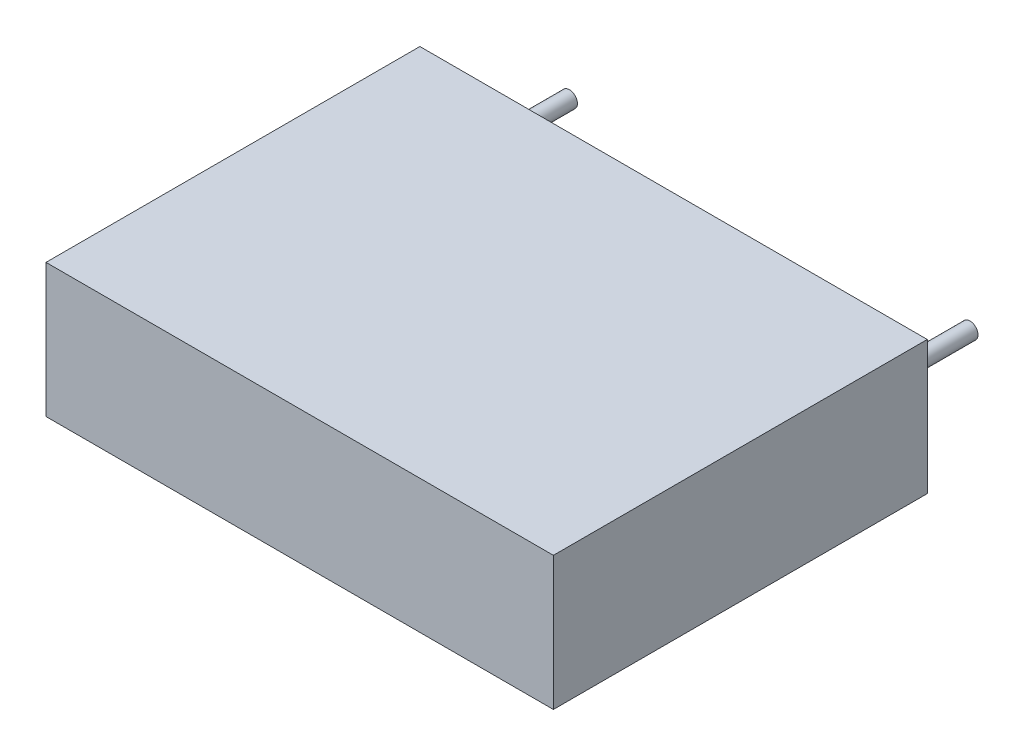
ISO-10303-21;
HEADER;
FILE_DESCRIPTION(('STEP AP214'),'2;1');
FILE_NAME('part.step','',(''),(''),'','','');
FILE_SCHEMA(('AUTOMOTIVE_DESIGN { 1 0 10303 214 1 1 1 1 }'));
ENDSEC;
DATA;
#1=APPLICATION_CONTEXT('core data for automotive mechanical design processes');
#2=APPLICATION_PROTOCOL_DEFINITION('international standard','automotive_design',2000,#1);
#3=PRODUCT_CONTEXT('',#1,'mechanical');
#4=PRODUCT('Part','Part','',(#3));
#5=PRODUCT_RELATED_PRODUCT_CATEGORY('part','',(#4));
#6=PRODUCT_DEFINITION_FORMATION('','',#4);
#7=PRODUCT_DEFINITION_CONTEXT('part definition',#1,'design');
#8=PRODUCT_DEFINITION('design','',#6,#7);
#9=PRODUCT_DEFINITION_SHAPE('','',#8);
#10=(LENGTH_UNIT() NAMED_UNIT(*) SI_UNIT(.MILLI.,.METRE.));
#11=(NAMED_UNIT(*) PLANE_ANGLE_UNIT() SI_UNIT($,.RADIAN.));
#12=(NAMED_UNIT(*) SI_UNIT($,.STERADIAN.) SOLID_ANGLE_UNIT());
#13=UNCERTAINTY_MEASURE_WITH_UNIT(LENGTH_MEASURE(1.E-05),#10,'distance_accuracy_value','');
#14=(GEOMETRIC_REPRESENTATION_CONTEXT(3) GLOBAL_UNCERTAINTY_ASSIGNED_CONTEXT((#13)) GLOBAL_UNIT_ASSIGNED_CONTEXT((#10,
#11,#12)) REPRESENTATION_CONTEXT('',''));
#15=CARTESIAN_POINT('',(0.,0.,0.));
#16=DIRECTION('',(0.,0.,1.));
#17=DIRECTION('',(1.,0.,0.));
#18=AXIS2_PLACEMENT_3D('',#15,#16,#17);
#19=CARTESIAN_POINT('',(9.5,-2.5,14.));
#20=DIRECTION('',(-1.,0.,0.));
#21=DIRECTION('',(0.,0.,1.));
#22=AXIS2_PLACEMENT_3D('',#19,#20,#21);
#23=PLANE('',#22);
#24=DIRECTION('',(0.,1.,0.));
#25=VECTOR('',#24,1.);
#26=CARTESIAN_POINT('',(9.5,-2.5,0.));
#27=LINE('',#26,#25);
#28=CARTESIAN_POINT('',(9.5,-2.5,0.));
#29=VERTEX_POINT('',#28);
#30=CARTESIAN_POINT('',(9.5,2.5,0.));
#31=VERTEX_POINT('',#30);
#32=EDGE_CURVE('E109',#29,#31,#27,.T.);
#33=ORIENTED_EDGE('',*,*,#32,.T.);
#34=DIRECTION('',(0.,0.,-1.));
#35=VECTOR('',#34,1.);
#36=CARTESIAN_POINT('',(9.5,2.5,14.));
#37=LINE('',#36,#35);
#38=CARTESIAN_POINT('',(9.5,2.5,14.));
#39=VERTEX_POINT('',#38);
#40=EDGE_CURVE('E11',#39,#31,#37,.T.);
#41=ORIENTED_EDGE('',*,*,#40,.F.);
#42=DIRECTION('',(0.,1.,0.));
#43=VECTOR('',#42,1.);
#44=CARTESIAN_POINT('',(9.5,-2.5,14.));
#45=LINE('',#44,#43);
#46=CARTESIAN_POINT('',(9.5,-2.5,14.));
#47=VERTEX_POINT('',#46);
#48=EDGE_CURVE('E93',#47,#39,#45,.T.);
#49=ORIENTED_EDGE('',*,*,#48,.F.);
#50=DIRECTION('',(0.,0.,-1.));
#51=VECTOR('',#50,1.);
#52=CARTESIAN_POINT('',(9.5,-2.5,14.));
#53=LINE('',#52,#51);
#54=EDGE_CURVE('E105',#47,#29,#53,.T.);
#55=ORIENTED_EDGE('',*,*,#54,.T.);
#56=EDGE_LOOP('',(#33,#41,#49,#55));
#57=FACE_BOUND('',#56,.T.);
#58=ADVANCED_FACE('F41',(#57),#23,.F.);
#59=CARTESIAN_POINT('',(-9.5,2.5,14.));
#60=DIRECTION('',(0.,-1.,0.));
#61=DIRECTION('',(0.,0.,-1.));
#62=AXIS2_PLACEMENT_3D('',#59,#60,#61);
#63=PLANE('',#62);
#64=DIRECTION('',(-1.,0.,0.));
#65=VECTOR('',#64,1.);
#66=CARTESIAN_POINT('',(-9.5,2.5,0.));
#67=LINE('',#66,#65);
#68=CARTESIAN_POINT('',(-9.5,2.5,0.));
#69=VERTEX_POINT('',#68);
#70=EDGE_CURVE('E98',#31,#69,#67,.T.);
#71=ORIENTED_EDGE('',*,*,#70,.T.);
#72=DIRECTION('',(0.,0.,-1.));
#73=VECTOR('',#72,1.);
#74=CARTESIAN_POINT('',(-9.5,2.5,14.));
#75=LINE('',#74,#73);
#76=CARTESIAN_POINT('',(-9.5,2.5,14.));
#77=VERTEX_POINT('',#76);
#78=EDGE_CURVE('E50',#77,#69,#75,.T.);
#79=ORIENTED_EDGE('',*,*,#78,.F.);
#80=DIRECTION('',(-1.,0.,0.));
#81=VECTOR('',#80,1.);
#82=CARTESIAN_POINT('',(-9.5,2.5,14.));
#83=LINE('',#82,#81);
#84=EDGE_CURVE('E88',#39,#77,#83,.T.);
#85=ORIENTED_EDGE('',*,*,#84,.F.);
#86=ORIENTED_EDGE('',*,*,#40,.T.);
#87=EDGE_LOOP('',(#71,#79,#85,#86));
#88=FACE_BOUND('',#87,.T.);
#89=ADVANCED_FACE('F97',(#88),#63,.F.);
#90=CARTESIAN_POINT('',(-9.5,-2.5,14.));
#91=DIRECTION('',(1.,0.,0.));
#92=DIRECTION('',(0.,0.,-1.));
#93=AXIS2_PLACEMENT_3D('',#90,#91,#92);
#94=PLANE('',#93);
#95=DIRECTION('',(0.,-1.,0.));
#96=VECTOR('',#95,1.);
#97=CARTESIAN_POINT('',(-9.5,-2.5,0.));
#98=LINE('',#97,#96);
#99=CARTESIAN_POINT('',(-9.5,-2.5,0.));
#100=VERTEX_POINT('',#99);
#101=EDGE_CURVE('E75',#69,#100,#98,.T.);
#102=ORIENTED_EDGE('',*,*,#101,.T.);
#103=DIRECTION('',(0.,0.,-1.));
#104=VECTOR('',#103,1.);
#105=CARTESIAN_POINT('',(-9.5,-2.5,14.));
#106=LINE('',#105,#104);
#107=CARTESIAN_POINT('',(-9.5,-2.5,14.));
#108=VERTEX_POINT('',#107);
#109=EDGE_CURVE('E100',#108,#100,#106,.T.);
#110=ORIENTED_EDGE('',*,*,#109,.F.);
#111=DIRECTION('',(0.,-1.,0.));
#112=VECTOR('',#111,1.);
#113=CARTESIAN_POINT('',(-9.5,-2.5,14.));
#114=LINE('',#113,#112);
#115=EDGE_CURVE('E91',#77,#108,#114,.T.);
#116=ORIENTED_EDGE('',*,*,#115,.F.);
#117=ORIENTED_EDGE('',*,*,#78,.T.);
#118=EDGE_LOOP('',(#102,#110,#116,#117));
#119=FACE_BOUND('',#118,.T.);
#120=ADVANCED_FACE('F101',(#119),#94,.F.);
#121=CARTESIAN_POINT('',(-9.5,-2.5,14.));
#122=DIRECTION('',(0.,1.,0.));
#123=DIRECTION('',(0.,0.,1.));
#124=AXIS2_PLACEMENT_3D('',#121,#122,#123);
#125=PLANE('',#124);
#126=DIRECTION('',(1.,0.,0.));
#127=VECTOR('',#126,1.);
#128=CARTESIAN_POINT('',(-9.5,-2.5,0.));
#129=LINE('',#128,#127);
#130=EDGE_CURVE('E81',#100,#29,#129,.T.);
#131=ORIENTED_EDGE('',*,*,#130,.T.);
#132=ORIENTED_EDGE('',*,*,#54,.F.);
#133=DIRECTION('',(1.,0.,0.));
#134=VECTOR('',#133,1.);
#135=CARTESIAN_POINT('',(-9.5,-2.5,14.));
#136=LINE('',#135,#134);
#137=EDGE_CURVE('E58',#108,#47,#136,.T.);
#138=ORIENTED_EDGE('',*,*,#137,.F.);
#139=ORIENTED_EDGE('',*,*,#109,.T.);
#140=EDGE_LOOP('',(#131,#132,#138,#139));
#141=FACE_BOUND('',#140,.T.);
#142=ADVANCED_FACE('F123',(#141),#125,.F.);
#143=CARTESIAN_POINT('',(0.,0.,14.));
#144=DIRECTION('',(0.,0.,-1.));
#145=DIRECTION('',(-1.,0.,0.));
#146=AXIS2_PLACEMENT_3D('',#143,#144,#145);
#147=PLANE('',#146);
#148=ORIENTED_EDGE('',*,*,#48,.T.);
#149=ORIENTED_EDGE('',*,*,#84,.T.);
#150=ORIENTED_EDGE('',*,*,#115,.T.);
#151=ORIENTED_EDGE('',*,*,#137,.T.);
#152=EDGE_LOOP('',(#148,#149,#150,#151));
#153=FACE_BOUND('',#152,.T.);
#154=ADVANCED_FACE('F89',(#153),#147,.F.);
#155=CARTESIAN_POINT('',(0.,0.,0.));
#156=DIRECTION('',(0.,0.,-1.));
#157=DIRECTION('',(-1.,0.,0.));
#158=AXIS2_PLACEMENT_3D('',#155,#156,#157);
#159=PLANE('',#158);
#160=CARTESIAN_POINT('',(-7.5,0.,0.));
#161=DIRECTION('',(0.,0.,-1.));
#162=DIRECTION('',(-1.,0.,0.));
#163=AXIS2_PLACEMENT_3D('',#160,#161,#162);
#164=CIRCLE('',#163,0.3);
#165=CARTESIAN_POINT('',(-7.8,0.,0.));
#166=VERTEX_POINT('',#165);
#167=EDGE_CURVE('E138',#166,#166,#164,.T.);
#168=ORIENTED_EDGE('',*,*,#167,.F.);
#169=EDGE_LOOP('',(#168));
#170=FACE_BOUND('',#169,.T.);
#171=CARTESIAN_POINT('',(7.5,0.,0.));
#172=DIRECTION('',(0.,0.,-1.));
#173=DIRECTION('',(-1.,0.,0.));
#174=AXIS2_PLACEMENT_3D('',#171,#172,#173);
#175=CIRCLE('',#174,0.3);
#176=CARTESIAN_POINT('',(7.2,0.,0.));
#177=VERTEX_POINT('',#176);
#178=EDGE_CURVE('E130',#177,#177,#175,.T.);
#179=ORIENTED_EDGE('',*,*,#178,.F.);
#180=EDGE_LOOP('',(#179));
#181=FACE_BOUND('',#180,.T.);
#182=ORIENTED_EDGE('',*,*,#32,.F.);
#183=ORIENTED_EDGE('',*,*,#130,.F.);
#184=ORIENTED_EDGE('',*,*,#101,.F.);
#185=ORIENTED_EDGE('',*,*,#70,.F.);
#186=EDGE_LOOP('',(#182,#183,#184,#185));
#187=FACE_BOUND('',#186,.T.);
#188=ADVANCED_FACE('F126',(#170,#181,#187),#159,.T.);
#189=CARTESIAN_POINT('',(7.5,0.,-3.6));
#190=DIRECTION('',(0.,0.,1.));
#191=DIRECTION('',(1.,0.,0.));
#192=AXIS2_PLACEMENT_3D('',#189,#190,#191);
#193=CYLINDRICAL_SURFACE('',#192,0.3);
#194=CARTESIAN_POINT('',(7.5,0.,-3.6));
#195=DIRECTION('',(0.,0.,-1.));
#196=DIRECTION('',(-1.,0.,0.));
#197=AXIS2_PLACEMENT_3D('',#194,#195,#196);
#198=CIRCLE('',#197,0.3);
#199=CARTESIAN_POINT('',(7.2,0.,-3.6));
#200=VERTEX_POINT('',#199);
#201=EDGE_CURVE('E113',#200,#200,#198,.T.);
#202=ORIENTED_EDGE('',*,*,#201,.F.);
#203=EDGE_LOOP('',(#202));
#204=FACE_BOUND('',#203,.T.);
#205=ORIENTED_EDGE('',*,*,#178,.T.);
#206=EDGE_LOOP('',(#205));
#207=FACE_BOUND('',#206,.T.);
#208=ADVANCED_FACE('F157',(#204,#207),#193,.T.);
#209=CARTESIAN_POINT('',(7.5,0.,-3.6));
#210=DIRECTION('',(0.,0.,-1.));
#211=DIRECTION('',(-1.,0.,0.));
#212=AXIS2_PLACEMENT_3D('',#209,#210,#211);
#213=PLANE('',#212);
#214=ORIENTED_EDGE('',*,*,#201,.T.);
#215=EDGE_LOOP('',(#214));
#216=FACE_BOUND('',#215,.T.);
#217=ADVANCED_FACE('F151',(#216),#213,.T.);
#218=CARTESIAN_POINT('',(-7.5,0.,-3.6));
#219=DIRECTION('',(0.,0.,1.));
#220=DIRECTION('',(1.,0.,0.));
#221=AXIS2_PLACEMENT_3D('',#218,#219,#220);
#222=CYLINDRICAL_SURFACE('',#221,0.3);
#223=CARTESIAN_POINT('',(-7.5,0.,-3.6));
#224=DIRECTION('',(0.,0.,-1.));
#225=DIRECTION('',(-1.,0.,0.));
#226=AXIS2_PLACEMENT_3D('',#223,#224,#225);
#227=CIRCLE('',#226,0.3);
#228=CARTESIAN_POINT('',(-7.8,0.,-3.6));
#229=VERTEX_POINT('',#228);
#230=EDGE_CURVE('E134',#229,#229,#227,.T.);
#231=ORIENTED_EDGE('',*,*,#230,.F.);
#232=EDGE_LOOP('',(#231));
#233=FACE_BOUND('',#232,.T.);
#234=ORIENTED_EDGE('',*,*,#167,.T.);
#235=EDGE_LOOP('',(#234));
#236=FACE_BOUND('',#235,.T.);
#237=ADVANCED_FACE('F148',(#233,#236),#222,.T.);
#238=CARTESIAN_POINT('',(-7.5,0.,-3.6));
#239=DIRECTION('',(0.,0.,-1.));
#240=DIRECTION('',(-1.,0.,0.));
#241=AXIS2_PLACEMENT_3D('',#238,#239,#240);
#242=PLANE('',#241);
#243=ORIENTED_EDGE('',*,*,#230,.T.);
#244=EDGE_LOOP('',(#243));
#245=FACE_BOUND('',#244,.T.);
#246=ADVANCED_FACE('F146',(#245),#242,.T.);
#247=CLOSED_SHELL('',(#58,#89,#120,#142,#154,#188,#208,#217,#237,#246));
#248=MANIFOLD_SOLID_BREP('B2',#247);
#249=ADVANCED_BREP_SHAPE_REPRESENTATION('',(#18,#248),#14);
#250=SHAPE_DEFINITION_REPRESENTATION(#9,#249);
ENDSEC;
END-ISO-10303-21;
